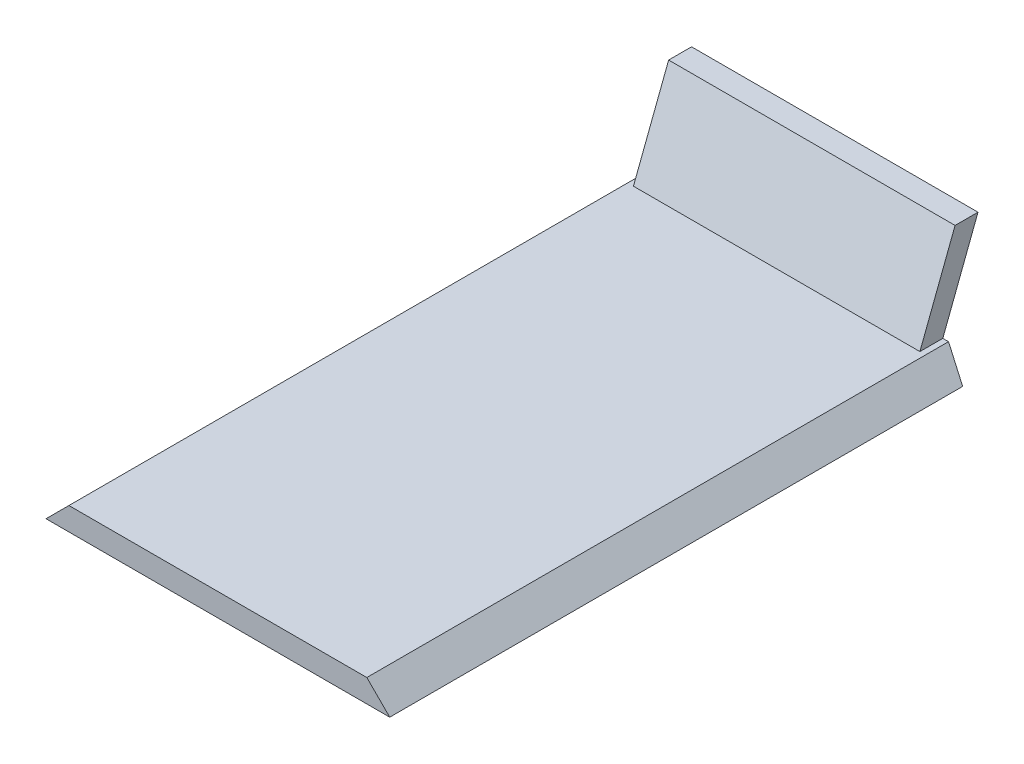
ISO-10303-21;
HEADER;
FILE_DESCRIPTION(('STEP AP214'),'2;1');
FILE_NAME('part.step','',(''),(''),'','','');
FILE_SCHEMA(('AUTOMOTIVE_DESIGN { 1 0 10303 214 1 1 1 1 }'));
ENDSEC;
DATA;
#1=APPLICATION_CONTEXT('core data for automotive mechanical design processes');
#2=APPLICATION_PROTOCOL_DEFINITION('international standard','automotive_design',2000,#1);
#3=PRODUCT_CONTEXT('',#1,'mechanical');
#4=PRODUCT('Part','Part','',(#3));
#5=PRODUCT_RELATED_PRODUCT_CATEGORY('part','',(#4));
#6=PRODUCT_DEFINITION_FORMATION('','',#4);
#7=PRODUCT_DEFINITION_CONTEXT('part definition',#1,'design');
#8=PRODUCT_DEFINITION('design','',#6,#7);
#9=PRODUCT_DEFINITION_SHAPE('','',#8);
#10=(LENGTH_UNIT() NAMED_UNIT(*) SI_UNIT(.MILLI.,.METRE.));
#11=(NAMED_UNIT(*) PLANE_ANGLE_UNIT() SI_UNIT($,.RADIAN.));
#12=(NAMED_UNIT(*) SI_UNIT($,.STERADIAN.) SOLID_ANGLE_UNIT());
#13=UNCERTAINTY_MEASURE_WITH_UNIT(LENGTH_MEASURE(1.E-05),#10,'distance_accuracy_value','');
#14=(GEOMETRIC_REPRESENTATION_CONTEXT(3) GLOBAL_UNCERTAINTY_ASSIGNED_CONTEXT((#13)) GLOBAL_UNIT_ASSIGNED_CONTEXT((#10,
#11,#12)) REPRESENTATION_CONTEXT('',''));
#15=CARTESIAN_POINT('',(0.,0.,0.));
#16=DIRECTION('',(0.,0.,1.));
#17=DIRECTION('',(1.,0.,0.));
#18=AXIS2_PLACEMENT_3D('',#15,#16,#17);
#19=CARTESIAN_POINT('',(38.1,0.,-19.5479404522668));
#20=DIRECTION('',(0.707106781186543,0.707106781186552,0.));
#21=DIRECTION('',(-0.707106781186552,0.707106781186543,0.));
#22=AXIS2_PLACEMENT_3D('',#19,#20,#21);
#23=PLANE('',#22);
#24=DIRECTION('',(0.,0.,1.));
#25=VECTOR('',#24,1.);
#26=CARTESIAN_POINT('',(38.1,0.,-19.5479404522668));
#27=LINE('',#26,#25);
#28=CARTESIAN_POINT('',(38.1,0.,0.));
#29=VERTEX_POINT('',#28);
#30=CARTESIAN_POINT('',(38.1,0.,127.));
#31=VERTEX_POINT('',#30);
#32=EDGE_CURVE('E69',#29,#31,#27,.T.);
#33=ORIENTED_EDGE('',*,*,#32,.F.);
#34=DIRECTION('',(-0.682414773418212,0.682414773418202,-0.261954488492094));
#35=VECTOR('',#34,1.);
#36=CARTESIAN_POINT('',(34.6055786356799,3.49442136432003,-1.34138268502186));
#37=LINE('',#36,#35);
#38=CARTESIAN_POINT('',(33.0199999999999,5.08,-1.95002929797993));
#39=VERTEX_POINT('',#38);
#40=EDGE_CURVE('E188',#29,#39,#37,.T.);
#41=ORIENTED_EDGE('',*,*,#40,.T.);
#42=DIRECTION('',(0.,0.,1.));
#43=VECTOR('',#42,1.);
#44=CARTESIAN_POINT('',(33.0199999999999,5.08,-19.5479404522668));
#45=LINE('',#44,#43);
#46=CARTESIAN_POINT('',(33.0199999999999,5.08,127.));
#47=VERTEX_POINT('',#46);
#48=EDGE_CURVE('E143',#39,#47,#45,.T.);
#49=ORIENTED_EDGE('',*,*,#48,.T.);
#50=DIRECTION('',(-0.707106781186552,0.707106781186543,0.));
#51=VECTOR('',#50,1.);
#52=CARTESIAN_POINT('',(38.1,0.,127.));
#53=LINE('',#52,#51);
#54=EDGE_CURVE('E162',#31,#47,#53,.T.);
#55=ORIENTED_EDGE('',*,*,#54,.F.);
#56=EDGE_LOOP('',(#33,#41,#49,#55));
#57=FACE_BOUND('',#56,.T.);
#58=ADVANCED_FACE('F46',(#57),#23,.T.);
#59=CARTESIAN_POINT('',(-38.1,0.,-19.5479404522668));
#60=DIRECTION('',(0.,-1.,0.));
#61=DIRECTION('',(1.,0.,0.));
#62=AXIS2_PLACEMENT_3D('',#59,#60,#61);
#63=PLANE('',#62);
#64=DIRECTION('',(0.,0.,1.));
#65=VECTOR('',#64,1.);
#66=CARTESIAN_POINT('',(-38.1,0.,-19.5479404522668));
#67=LINE('',#66,#65);
#68=CARTESIAN_POINT('',(-38.1,0.,0.));
#69=VERTEX_POINT('',#68);
#70=CARTESIAN_POINT('',(-38.1,0.,127.));
#71=VERTEX_POINT('',#70);
#72=EDGE_CURVE('E140',#69,#71,#67,.T.);
#73=ORIENTED_EDGE('',*,*,#72,.F.);
#74=DIRECTION('',(1.,0.,0.));
#75=VECTOR('',#74,1.);
#76=CARTESIAN_POINT('',(-38.1,0.,0.));
#77=LINE('',#76,#75);
#78=EDGE_CURVE('E192',#69,#29,#77,.T.);
#79=ORIENTED_EDGE('',*,*,#78,.T.);
#80=ORIENTED_EDGE('',*,*,#32,.T.);
#81=DIRECTION('',(1.,0.,0.));
#82=VECTOR('',#81,1.);
#83=CARTESIAN_POINT('',(-38.1,0.,127.));
#84=LINE('',#83,#82);
#85=EDGE_CURVE('E147',#71,#31,#84,.T.);
#86=ORIENTED_EDGE('',*,*,#85,.F.);
#87=EDGE_LOOP('',(#73,#79,#80,#86));
#88=FACE_BOUND('',#87,.T.);
#89=ADVANCED_FACE('F200',(#88),#63,.T.);
#90=CARTESIAN_POINT('',(-33.02,5.07999999999999,-19.5479404522668));
#91=DIRECTION('',(-0.707106781186543,0.707106781186551,0.));
#92=DIRECTION('',(-0.707106781186552,-0.707106781186544,0.));
#93=AXIS2_PLACEMENT_3D('',#90,#91,#92);
#94=PLANE('',#93);
#95=DIRECTION('',(0.,0.,1.));
#96=VECTOR('',#95,1.);
#97=CARTESIAN_POINT('',(-33.02,5.07999999999999,-19.5479404522668));
#98=LINE('',#97,#96);
#99=CARTESIAN_POINT('',(-33.02,5.07999999999999,-1.95002929797994));
#100=VERTEX_POINT('',#99);
#101=CARTESIAN_POINT('',(-33.02,5.07999999999999,127.));
#102=VERTEX_POINT('',#101);
#103=EDGE_CURVE('E146',#100,#102,#98,.T.);
#104=ORIENTED_EDGE('',*,*,#103,.F.);
#105=DIRECTION('',(-0.682414773418211,-0.682414773418203,0.261954488492094));
#106=VECTOR('',#105,1.);
#107=CARTESIAN_POINT('',(-29.874169018209,8.22583098179095,-3.15760067218965));
#108=LINE('',#107,#106);
#109=EDGE_CURVE('E61',#100,#69,#108,.T.);
#110=ORIENTED_EDGE('',*,*,#109,.T.);
#111=ORIENTED_EDGE('',*,*,#72,.T.);
#112=DIRECTION('',(-0.707106781186552,-0.707106781186544,0.));
#113=VECTOR('',#112,1.);
#114=CARTESIAN_POINT('',(-33.02,5.07999999999999,127.));
#115=LINE('',#114,#113);
#116=EDGE_CURVE('E154',#102,#71,#115,.T.);
#117=ORIENTED_EDGE('',*,*,#116,.F.);
#118=EDGE_LOOP('',(#104,#110,#111,#117));
#119=FACE_BOUND('',#118,.T.);
#120=ADVANCED_FACE('F198',(#119),#94,.T.);
#121=CARTESIAN_POINT('',(33.0199999999999,5.08,-19.5479404522668));
#122=DIRECTION('',(0.,1.,0.));
#123=DIRECTION('',(-1.,0.,0.));
#124=AXIS2_PLACEMENT_3D('',#121,#122,#123);
#125=PLANE('',#124);
#126=ORIENTED_EDGE('',*,*,#48,.F.);
#127=DIRECTION('',(-1.,0.,0.));
#128=VECTOR('',#127,1.);
#129=CARTESIAN_POINT('',(33.0199999999999,5.08,-1.95002929797994));
#130=LINE('',#129,#128);
#131=CARTESIAN_POINT('',(31.75,5.08,-1.95002929797994));
#132=VERTEX_POINT('',#131);
#133=EDGE_CURVE('E122',#39,#132,#130,.T.);
#134=ORIENTED_EDGE('',*,*,#133,.T.);
#135=DIRECTION('',(0.,0.,-1.));
#136=VECTOR('',#135,1.);
#137=CARTESIAN_POINT('',(31.75,5.08,-19.5479404522668));
#138=LINE('',#137,#136);
#139=CARTESIAN_POINT('',(31.75,5.08,3.12997070202006));
#140=VERTEX_POINT('',#139);
#141=EDGE_CURVE('E12',#140,#132,#138,.T.);
#142=ORIENTED_EDGE('',*,*,#141,.F.);
#143=DIRECTION('',(-1.,0.,0.));
#144=VECTOR('',#143,1.);
#145=CARTESIAN_POINT('',(33.0199999999999,5.08,3.12997070202006));
#146=LINE('',#145,#144);
#147=CARTESIAN_POINT('',(-31.75,5.07999999999999,3.12997070202006));
#148=VERTEX_POINT('',#147);
#149=EDGE_CURVE('E54',#140,#148,#146,.T.);
#150=ORIENTED_EDGE('',*,*,#149,.T.);
#151=DIRECTION('',(0.,0.,-1.));
#152=VECTOR('',#151,1.);
#153=CARTESIAN_POINT('',(-31.75,5.07999999999999,-19.5479404522668));
#154=LINE('',#153,#152);
#155=CARTESIAN_POINT('',(-31.75,5.07999999999999,-1.95002929797993));
#156=VERTEX_POINT('',#155);
#157=EDGE_CURVE('E127',#148,#156,#154,.T.);
#158=ORIENTED_EDGE('',*,*,#157,.T.);
#159=EDGE_CURVE('E110',#156,#100,#130,.T.);
#160=ORIENTED_EDGE('',*,*,#159,.T.);
#161=ORIENTED_EDGE('',*,*,#103,.T.);
#162=DIRECTION('',(-1.,0.,0.));
#163=VECTOR('',#162,1.);
#164=CARTESIAN_POINT('',(33.0199999999999,5.08,127.));
#165=LINE('',#164,#163);
#166=EDGE_CURVE('E158',#47,#102,#165,.T.);
#167=ORIENTED_EDGE('',*,*,#166,.F.);
#168=EDGE_LOOP('',(#126,#134,#142,#150,#158,#160,#161,#167));
#169=FACE_BOUND('',#168,.T.);
#170=ADVANCED_FACE('F134',(#169),#125,.T.);
#171=CARTESIAN_POINT('',(0.,0.,127.));
#172=DIRECTION('',(0.,0.,1.));
#173=DIRECTION('',(1.,0.,0.));
#174=AXIS2_PLACEMENT_3D('',#171,#172,#173);
#175=PLANE('',#174);
#176=ORIENTED_EDGE('',*,*,#54,.T.);
#177=ORIENTED_EDGE('',*,*,#166,.T.);
#178=ORIENTED_EDGE('',*,*,#116,.T.);
#179=ORIENTED_EDGE('',*,*,#85,.T.);
#180=EDGE_LOOP('',(#176,#177,#178,#179));
#181=FACE_BOUND('',#180,.T.);
#182=ADVANCED_FACE('F203',(#181),#175,.T.);
#183=CARTESIAN_POINT('',(31.75,0.,0.));
#184=DIRECTION('',(0.,0.358367949545304,0.9335804264972));
#185=DIRECTION('',(0.,-0.9335804264972,0.358367949545304));
#186=AXIS2_PLACEMENT_3D('',#183,#184,#185);
#187=PLANE('',#186);
#188=DIRECTION('',(0.,0.9335804264972,-0.358367949545304));
#189=VECTOR('',#188,1.);
#190=CARTESIAN_POINT('',(31.75,0.,0.));
#191=LINE('',#190,#189);
#192=CARTESIAN_POINT('',(31.75,25.4,-9.75014648989969));
#193=VERTEX_POINT('',#192);
#194=EDGE_CURVE('E177',#132,#193,#191,.T.);
#195=ORIENTED_EDGE('',*,*,#194,.F.);
#196=ORIENTED_EDGE('',*,*,#133,.F.);
#197=ORIENTED_EDGE('',*,*,#40,.F.);
#198=ORIENTED_EDGE('',*,*,#78,.F.);
#199=ORIENTED_EDGE('',*,*,#109,.F.);
#200=ORIENTED_EDGE('',*,*,#159,.F.);
#201=DIRECTION('',(0.,0.9335804264972,-0.358367949545304));
#202=VECTOR('',#201,1.);
#203=CARTESIAN_POINT('',(-31.75,0.,0.));
#204=LINE('',#203,#202);
#205=CARTESIAN_POINT('',(-31.75,25.4,-9.75014648989969));
#206=VERTEX_POINT('',#205);
#207=EDGE_CURVE('E115',#156,#206,#204,.T.);
#208=ORIENTED_EDGE('',*,*,#207,.T.);
#209=DIRECTION('',(-1.,0.,0.));
#210=VECTOR('',#209,1.);
#211=CARTESIAN_POINT('',(31.75,25.4,-9.75014648989969));
#212=LINE('',#211,#210);
#213=EDGE_CURVE('E166',#193,#206,#212,.T.);
#214=ORIENTED_EDGE('',*,*,#213,.F.);
#215=EDGE_LOOP('',(#195,#196,#197,#198,#199,#200,#208,#214));
#216=FACE_BOUND('',#215,.T.);
#217=ADVANCED_FACE('F113',(#216),#187,.F.);
#218=CARTESIAN_POINT('',(31.75,25.4,-9.75014648989969));
#219=DIRECTION('',(0.,-1.,0.));
#220=DIRECTION('',(0.,0.,-1.));
#221=AXIS2_PLACEMENT_3D('',#218,#219,#220);
#222=PLANE('',#221);
#223=DIRECTION('',(0.,0.,1.));
#224=VECTOR('',#223,1.);
#225=CARTESIAN_POINT('',(-31.75,25.4,-9.75014648989969));
#226=LINE('',#225,#224);
#227=CARTESIAN_POINT('',(-31.75,25.4,-4.67014648989969));
#228=VERTEX_POINT('',#227);
#229=EDGE_CURVE('E129',#206,#228,#226,.T.);
#230=ORIENTED_EDGE('',*,*,#229,.T.);
#231=DIRECTION('',(-1.,0.,0.));
#232=VECTOR('',#231,1.);
#233=CARTESIAN_POINT('',(31.75,25.4,-4.67014648989969));
#234=LINE('',#233,#232);
#235=CARTESIAN_POINT('',(31.75,25.4,-4.67014648989969));
#236=VERTEX_POINT('',#235);
#237=EDGE_CURVE('E169',#236,#228,#234,.T.);
#238=ORIENTED_EDGE('',*,*,#237,.F.);
#239=DIRECTION('',(0.,0.,1.));
#240=VECTOR('',#239,1.);
#241=CARTESIAN_POINT('',(31.75,25.4,-9.75014648989969));
#242=LINE('',#241,#240);
#243=EDGE_CURVE('E183',#193,#236,#242,.T.);
#244=ORIENTED_EDGE('',*,*,#243,.F.);
#245=ORIENTED_EDGE('',*,*,#213,.T.);
#246=EDGE_LOOP('',(#230,#238,#244,#245));
#247=FACE_BOUND('',#246,.T.);
#248=ADVANCED_FACE('F213',(#247),#222,.F.);
#249=CARTESIAN_POINT('',(31.75,25.4,-4.67014648989969));
#250=DIRECTION('',(0.,-0.358367949545304,-0.9335804264972));
#251=DIRECTION('',(0.,0.9335804264972,-0.358367949545304));
#252=AXIS2_PLACEMENT_3D('',#249,#250,#251);
#253=PLANE('',#252);
#254=ORIENTED_EDGE('',*,*,#149,.F.);
#255=DIRECTION('',(0.,-0.9335804264972,0.358367949545304));
#256=VECTOR('',#255,1.);
#257=CARTESIAN_POINT('',(31.75,25.4,-4.67014648989969));
#258=LINE('',#257,#256);
#259=EDGE_CURVE('E173',#236,#140,#258,.T.);
#260=ORIENTED_EDGE('',*,*,#259,.F.);
#261=ORIENTED_EDGE('',*,*,#237,.T.);
#262=DIRECTION('',(0.,-0.9335804264972,0.358367949545304));
#263=VECTOR('',#262,1.);
#264=CARTESIAN_POINT('',(-31.75,25.4,-4.67014648989969));
#265=LINE('',#264,#263);
#266=EDGE_CURVE('E174',#228,#148,#265,.T.);
#267=ORIENTED_EDGE('',*,*,#266,.T.);
#268=EDGE_LOOP('',(#254,#260,#261,#267));
#269=FACE_BOUND('',#268,.T.);
#270=ADVANCED_FACE('F215',(#269),#253,.F.);
#271=CARTESIAN_POINT('',(31.75,0.,0.));
#272=DIRECTION('',(1.,0.,0.));
#273=DIRECTION('',(0.,0.,-1.));
#274=AXIS2_PLACEMENT_3D('',#271,#272,#273);
#275=PLANE('',#274);
#276=ORIENTED_EDGE('',*,*,#259,.T.);
#277=ORIENTED_EDGE('',*,*,#141,.T.);
#278=ORIENTED_EDGE('',*,*,#194,.T.);
#279=ORIENTED_EDGE('',*,*,#243,.T.);
#280=EDGE_LOOP('',(#276,#277,#278,#279));
#281=FACE_BOUND('',#280,.T.);
#282=ADVANCED_FACE('F208',(#281),#275,.T.);
#283=CARTESIAN_POINT('',(-31.75,0.,0.));
#284=DIRECTION('',(1.,0.,0.));
#285=DIRECTION('',(0.,0.,-1.));
#286=AXIS2_PLACEMENT_3D('',#283,#284,#285);
#287=PLANE('',#286);
#288=ORIENTED_EDGE('',*,*,#157,.F.);
#289=ORIENTED_EDGE('',*,*,#266,.F.);
#290=ORIENTED_EDGE('',*,*,#229,.F.);
#291=ORIENTED_EDGE('',*,*,#207,.F.);
#292=EDGE_LOOP('',(#288,#289,#290,#291));
#293=FACE_BOUND('',#292,.T.);
#294=ADVANCED_FACE('F125',(#293),#287,.F.);
#295=CLOSED_SHELL('',(#58,#89,#120,#170,#182,#217,#248,#270,#282,#294));
#296=MANIFOLD_SOLID_BREP('B2',#295);
#297=ADVANCED_BREP_SHAPE_REPRESENTATION('',(#18,#296),#14);
#298=SHAPE_DEFINITION_REPRESENTATION(#9,#297);
ENDSEC;
END-ISO-10303-21;
